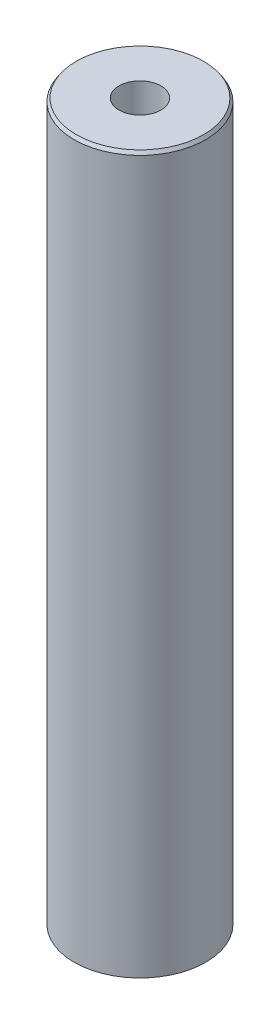
ISO-10303-21;
HEADER;
FILE_DESCRIPTION(('STEP AP214'),'2;1');
FILE_NAME('part.step','',(''),(''),'','','');
FILE_SCHEMA(('AUTOMOTIVE_DESIGN { 1 0 10303 214 1 1 1 1 }'));
ENDSEC;
DATA;
#1=APPLICATION_CONTEXT('core data for automotive mechanical design processes');
#2=APPLICATION_PROTOCOL_DEFINITION('international standard','automotive_design',2000,#1);
#3=PRODUCT_CONTEXT('',#1,'mechanical');
#4=PRODUCT('Part','Part','',(#3));
#5=PRODUCT_RELATED_PRODUCT_CATEGORY('part','',(#4));
#6=PRODUCT_DEFINITION_FORMATION('','',#4);
#7=PRODUCT_DEFINITION_CONTEXT('part definition',#1,'design');
#8=PRODUCT_DEFINITION('design','',#6,#7);
#9=PRODUCT_DEFINITION_SHAPE('','',#8);
#10=(LENGTH_UNIT() NAMED_UNIT(*) SI_UNIT(.MILLI.,.METRE.));
#11=(NAMED_UNIT(*) PLANE_ANGLE_UNIT() SI_UNIT($,.RADIAN.));
#12=(NAMED_UNIT(*) SI_UNIT($,.STERADIAN.) SOLID_ANGLE_UNIT());
#13=UNCERTAINTY_MEASURE_WITH_UNIT(LENGTH_MEASURE(1.E-05),#10,'distance_accuracy_value','');
#14=(GEOMETRIC_REPRESENTATION_CONTEXT(3) GLOBAL_UNCERTAINTY_ASSIGNED_CONTEXT((#13)) GLOBAL_UNIT_ASSIGNED_CONTEXT((#10,
#11,#12)) REPRESENTATION_CONTEXT('',''));
#15=CARTESIAN_POINT('',(0.,0.,0.));
#16=DIRECTION('',(0.,0.,1.));
#17=DIRECTION('',(1.,0.,0.));
#18=AXIS2_PLACEMENT_3D('',#15,#16,#17);
#19=CARTESIAN_POINT('',(0.,600.,0.));
#20=DIRECTION('',(0.,-1.,0.));
#21=DIRECTION('',(0.,0.,-1.));
#22=AXIS2_PLACEMENT_3D('',#19,#20,#21);
#23=CYLINDRICAL_SURFACE('',#22,55.);
#24=CARTESIAN_POINT('',(0.,597.291220604649,0.));
#25=DIRECTION('',(0.,1.,0.));
#26=DIRECTION('',(0.,0.,1.));
#27=AXIS2_PLACEMENT_3D('',#24,#25,#26);
#28=CIRCLE('',#27,55.);
#29=CARTESIAN_POINT('',(0.,597.291220604649,55.));
#30=VERTEX_POINT('',#29);
#31=EDGE_CURVE('E50',#30,#30,#28,.F.);
#32=ORIENTED_EDGE('',*,*,#31,.T.);
#33=EDGE_LOOP('',(#32));
#34=FACE_BOUND('',#33,.T.);
#35=CARTESIAN_POINT('',(0.,1.80665286165738,0.));
#36=DIRECTION('',(0.,1.,0.));
#37=DIRECTION('',(0.,0.,1.));
#38=AXIS2_PLACEMENT_3D('',#35,#36,#37);
#39=CIRCLE('',#38,55.);
#40=CARTESIAN_POINT('',(0.,1.80665286165738,55.));
#41=VERTEX_POINT('',#40);
#42=EDGE_CURVE('E51',#41,#41,#39,.T.);
#43=ORIENTED_EDGE('',*,*,#42,.T.);
#44=EDGE_LOOP('',(#43));
#45=FACE_BOUND('',#44,.T.);
#46=ADVANCED_FACE('F39',(#34,#45),#23,.T.);
#47=CARTESIAN_POINT('',(0.,600.,0.));
#48=DIRECTION('',(0.,1.,0.));
#49=DIRECTION('',(0.,0.,1.));
#50=AXIS2_PLACEMENT_3D('',#47,#48,#49);
#51=PLANE('',#50);
#52=CARTESIAN_POINT('',(0.,600.,0.));
#53=DIRECTION('',(0.,1.,0.));
#54=DIRECTION('',(0.,0.,1.));
#55=AXIS2_PLACEMENT_3D('',#52,#53,#54);
#56=CIRCLE('',#55,53.1933471383426);
#57=CARTESIAN_POINT('',(0.,600.,53.1933471383426));
#58=VERTEX_POINT('',#57);
#59=EDGE_CURVE('E54',#58,#58,#56,.T.);
#60=ORIENTED_EDGE('',*,*,#59,.T.);
#61=EDGE_LOOP('',(#60));
#62=FACE_BOUND('',#61,.T.);
#63=CARTESIAN_POINT('',(0.,600.,0.));
#64=DIRECTION('',(0.,1.,0.));
#65=DIRECTION('',(0.,0.,1.));
#66=AXIS2_PLACEMENT_3D('',#63,#64,#65);
#67=CIRCLE('',#66,17.5492369618471);
#68=CARTESIAN_POINT('',(0.,600.,17.5492369618471));
#69=VERTEX_POINT('',#68);
#70=EDGE_CURVE('E58',#69,#69,#67,.T.);
#71=ORIENTED_EDGE('',*,*,#70,.F.);
#72=EDGE_LOOP('',(#71));
#73=FACE_BOUND('',#72,.T.);
#74=ADVANCED_FACE('F69',(#62,#73),#51,.T.);
#75=CARTESIAN_POINT('',(0.,0.,0.));
#76=DIRECTION('',(0.,1.,0.));
#77=DIRECTION('',(0.,0.,1.));
#78=AXIS2_PLACEMENT_3D('',#75,#76,#77);
#79=PLANE('',#78);
#80=CARTESIAN_POINT('',(0.,0.,0.));
#81=DIRECTION('',(0.,1.,0.));
#82=DIRECTION('',(0.,0.,1.));
#83=AXIS2_PLACEMENT_3D('',#80,#81,#82);
#84=CIRCLE('',#83,52.2912206046493);
#85=CARTESIAN_POINT('',(0.,0.,52.2912206046493));
#86=VERTEX_POINT('',#85);
#87=EDGE_CURVE('E10',#86,#86,#84,.F.);
#88=ORIENTED_EDGE('',*,*,#87,.T.);
#89=EDGE_LOOP('',(#88));
#90=FACE_BOUND('',#89,.T.);
#91=CARTESIAN_POINT('',(0.,0.,0.));
#92=DIRECTION('',(0.,1.,0.));
#93=DIRECTION('',(0.,0.,1.));
#94=AXIS2_PLACEMENT_3D('',#91,#92,#93);
#95=CIRCLE('',#94,17.5492369618471);
#96=CARTESIAN_POINT('',(0.,0.,17.5492369618471));
#97=VERTEX_POINT('',#96);
#98=EDGE_CURVE('E63',#97,#97,#95,.T.);
#99=ORIENTED_EDGE('',*,*,#98,.T.);
#100=EDGE_LOOP('',(#99));
#101=FACE_BOUND('',#100,.T.);
#102=ADVANCED_FACE('F75',(#90,#101),#79,.F.);
#103=CARTESIAN_POINT('',(0.,600.,0.));
#104=DIRECTION('',(0.,-1.,0.));
#105=DIRECTION('',(0.,0.,-1.));
#106=AXIS2_PLACEMENT_3D('',#103,#104,#105);
#107=CYLINDRICAL_SURFACE('',#106,17.5492369618471);
#108=ORIENTED_EDGE('',*,*,#70,.T.);
#109=EDGE_LOOP('',(#108));
#110=FACE_BOUND('',#109,.T.);
#111=ORIENTED_EDGE('',*,*,#98,.F.);
#112=EDGE_LOOP('',(#111));
#113=FACE_BOUND('',#112,.T.);
#114=ADVANCED_FACE('F70',(#110,#113),#107,.F.);
#115=CARTESIAN_POINT('',(0.,600.,0.));
#116=DIRECTION('',(0.,-1.,0.));
#117=DIRECTION('',(0.,0.,-1.));
#118=AXIS2_PLACEMENT_3D('',#115,#116,#117);
#119=CONICAL_SURFACE('',#118,53.1933471383426,0.588207021522757);
#120=ORIENTED_EDGE('',*,*,#31,.F.);
#121=EDGE_LOOP('',(#120));
#122=FACE_BOUND('',#121,.T.);
#123=ORIENTED_EDGE('',*,*,#59,.F.);
#124=EDGE_LOOP('',(#123));
#125=FACE_BOUND('',#124,.T.);
#126=ADVANCED_FACE('F81',(#122,#125),#119,.T.);
#127=CARTESIAN_POINT('',(0.,1.80665286165738,0.));
#128=DIRECTION('',(0.,1.,0.));
#129=DIRECTION('',(0.,0.,1.));
#130=AXIS2_PLACEMENT_3D('',#127,#128,#129);
#131=CONICAL_SURFACE('',#130,55.,0.982589305272146);
#132=ORIENTED_EDGE('',*,*,#87,.F.);
#133=EDGE_LOOP('',(#132));
#134=FACE_BOUND('',#133,.T.);
#135=ORIENTED_EDGE('',*,*,#42,.F.);
#136=EDGE_LOOP('',(#135));
#137=FACE_BOUND('',#136,.T.);
#138=ADVANCED_FACE('F45',(#134,#137),#131,.T.);
#139=CLOSED_SHELL('',(#46,#74,#102,#114,#126,#138));
#140=MANIFOLD_SOLID_BREP('B2',#139);
#141=ADVANCED_BREP_SHAPE_REPRESENTATION('',(#18,#140),#14);
#142=SHAPE_DEFINITION_REPRESENTATION(#9,#141);
ENDSEC;
END-ISO-10303-21;
